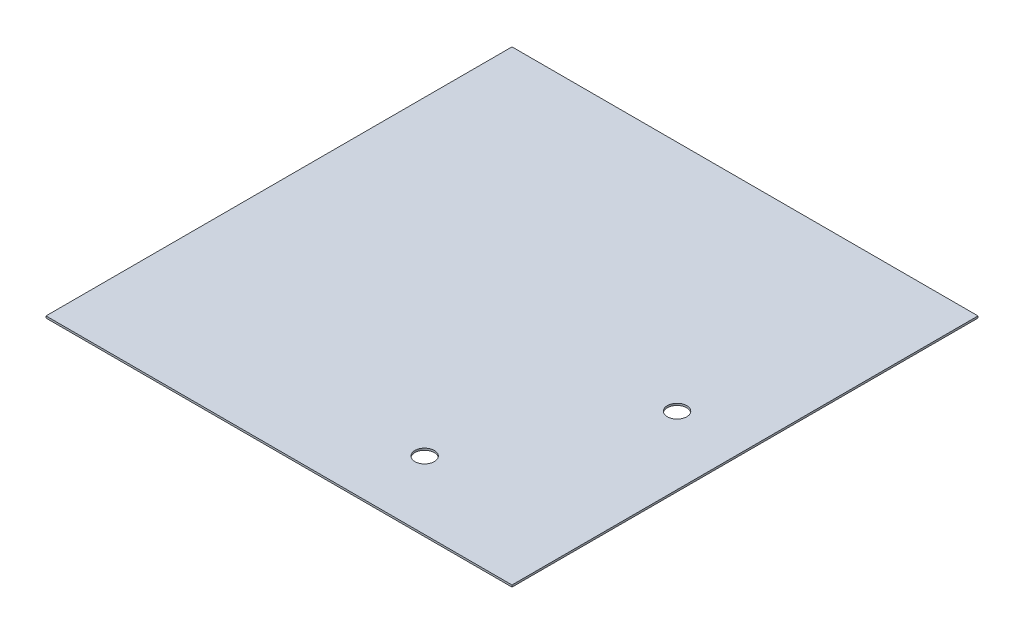
ISO-10303-21;
HEADER;
FILE_DESCRIPTION(('STEP AP214'),'2;1');
FILE_NAME('part.step','',(''),(''),'','','');
FILE_SCHEMA(('AUTOMOTIVE_DESIGN { 1 0 10303 214 1 1 1 1 }'));
ENDSEC;
DATA;
#1=APPLICATION_CONTEXT('core data for automotive mechanical design processes');
#2=APPLICATION_PROTOCOL_DEFINITION('international standard','automotive_design',2000,#1);
#3=PRODUCT_CONTEXT('',#1,'mechanical');
#4=PRODUCT('Part','Part','',(#3));
#5=PRODUCT_RELATED_PRODUCT_CATEGORY('part','',(#4));
#6=PRODUCT_DEFINITION_FORMATION('','',#4);
#7=PRODUCT_DEFINITION_CONTEXT('part definition',#1,'design');
#8=PRODUCT_DEFINITION('design','',#6,#7);
#9=PRODUCT_DEFINITION_SHAPE('','',#8);
#10=(LENGTH_UNIT() NAMED_UNIT(*) SI_UNIT(.MILLI.,.METRE.));
#11=(NAMED_UNIT(*) PLANE_ANGLE_UNIT() SI_UNIT($,.RADIAN.));
#12=(NAMED_UNIT(*) SI_UNIT($,.STERADIAN.) SOLID_ANGLE_UNIT());
#13=UNCERTAINTY_MEASURE_WITH_UNIT(LENGTH_MEASURE(1.E-05),#10,'distance_accuracy_value','');
#14=(GEOMETRIC_REPRESENTATION_CONTEXT(3) GLOBAL_UNCERTAINTY_ASSIGNED_CONTEXT((#13)) GLOBAL_UNIT_ASSIGNED_CONTEXT((#10,
#11,#12)) REPRESENTATION_CONTEXT('',''));
#15=CARTESIAN_POINT('',(0.,0.,0.));
#16=DIRECTION('',(0.,0.,1.));
#17=DIRECTION('',(1.,0.,0.));
#18=AXIS2_PLACEMENT_3D('',#15,#16,#17);
#19=CARTESIAN_POINT('',(304.8,2.5,304.8));
#20=DIRECTION('',(-1.,0.,0.));
#21=DIRECTION('',(0.,0.,1.));
#22=AXIS2_PLACEMENT_3D('',#19,#20,#21);
#23=PLANE('',#22);
#24=DIRECTION('',(0.,0.,-1.));
#25=VECTOR('',#24,1.);
#26=CARTESIAN_POINT('',(304.8,0.,304.8));
#27=LINE('',#26,#25);
#28=CARTESIAN_POINT('',(304.8,0.,304.8));
#29=VERTEX_POINT('',#28);
#30=CARTESIAN_POINT('',(304.8,0.,-304.8));
#31=VERTEX_POINT('',#30);
#32=EDGE_CURVE('E106',#29,#31,#27,.T.);
#33=ORIENTED_EDGE('',*,*,#32,.T.);
#34=DIRECTION('',(0.,-1.,0.));
#35=VECTOR('',#34,1.);
#36=CARTESIAN_POINT('',(304.8,2.5,-304.8));
#37=LINE('',#36,#35);
#38=CARTESIAN_POINT('',(304.8,2.5,-304.8));
#39=VERTEX_POINT('',#38);
#40=EDGE_CURVE('E11',#39,#31,#37,.T.);
#41=ORIENTED_EDGE('',*,*,#40,.F.);
#42=DIRECTION('',(0.,0.,-1.));
#43=VECTOR('',#42,1.);
#44=CARTESIAN_POINT('',(304.8,2.5,304.8));
#45=LINE('',#44,#43);
#46=CARTESIAN_POINT('',(304.8,2.5,304.8));
#47=VERTEX_POINT('',#46);
#48=EDGE_CURVE('E90',#47,#39,#45,.T.);
#49=ORIENTED_EDGE('',*,*,#48,.F.);
#50=DIRECTION('',(0.,-1.,0.));
#51=VECTOR('',#50,1.);
#52=CARTESIAN_POINT('',(304.8,2.5,304.8));
#53=LINE('',#52,#51);
#54=EDGE_CURVE('E102',#47,#29,#53,.T.);
#55=ORIENTED_EDGE('',*,*,#54,.T.);
#56=EDGE_LOOP('',(#33,#41,#49,#55));
#57=FACE_BOUND('',#56,.T.);
#58=ADVANCED_FACE('F38',(#57),#23,.F.);
#59=CARTESIAN_POINT('',(-304.8,2.5,-304.8));
#60=DIRECTION('',(0.,0.,1.));
#61=DIRECTION('',(1.,0.,0.));
#62=AXIS2_PLACEMENT_3D('',#59,#60,#61);
#63=PLANE('',#62);
#64=DIRECTION('',(-1.,0.,0.));
#65=VECTOR('',#64,1.);
#66=CARTESIAN_POINT('',(-304.8,0.,-304.8));
#67=LINE('',#66,#65);
#68=CARTESIAN_POINT('',(-304.8,0.,-304.8));
#69=VERTEX_POINT('',#68);
#70=EDGE_CURVE('E95',#31,#69,#67,.T.);
#71=ORIENTED_EDGE('',*,*,#70,.T.);
#72=DIRECTION('',(0.,-1.,0.));
#73=VECTOR('',#72,1.);
#74=CARTESIAN_POINT('',(-304.8,2.5,-304.8));
#75=LINE('',#74,#73);
#76=CARTESIAN_POINT('',(-304.8,2.5,-304.8));
#77=VERTEX_POINT('',#76);
#78=EDGE_CURVE('E47',#77,#69,#75,.T.);
#79=ORIENTED_EDGE('',*,*,#78,.F.);
#80=DIRECTION('',(-1.,0.,0.));
#81=VECTOR('',#80,1.);
#82=CARTESIAN_POINT('',(-304.8,2.5,-304.8));
#83=LINE('',#82,#81);
#84=EDGE_CURVE('E85',#39,#77,#83,.T.);
#85=ORIENTED_EDGE('',*,*,#84,.F.);
#86=ORIENTED_EDGE('',*,*,#40,.T.);
#87=EDGE_LOOP('',(#71,#79,#85,#86));
#88=FACE_BOUND('',#87,.T.);
#89=ADVANCED_FACE('F94',(#88),#63,.F.);
#90=CARTESIAN_POINT('',(-304.8,2.5,304.8));
#91=DIRECTION('',(1.,0.,0.));
#92=DIRECTION('',(0.,0.,-1.));
#93=AXIS2_PLACEMENT_3D('',#90,#91,#92);
#94=PLANE('',#93);
#95=DIRECTION('',(0.,0.,1.));
#96=VECTOR('',#95,1.);
#97=CARTESIAN_POINT('',(-304.8,0.,304.8));
#98=LINE('',#97,#96);
#99=CARTESIAN_POINT('',(-304.8,0.,304.8));
#100=VERTEX_POINT('',#99);
#101=EDGE_CURVE('E72',#69,#100,#98,.T.);
#102=ORIENTED_EDGE('',*,*,#101,.T.);
#103=DIRECTION('',(0.,-1.,0.));
#104=VECTOR('',#103,1.);
#105=CARTESIAN_POINT('',(-304.8,2.5,304.8));
#106=LINE('',#105,#104);
#107=CARTESIAN_POINT('',(-304.8,2.5,304.8));
#108=VERTEX_POINT('',#107);
#109=EDGE_CURVE('E97',#108,#100,#106,.T.);
#110=ORIENTED_EDGE('',*,*,#109,.F.);
#111=DIRECTION('',(0.,0.,1.));
#112=VECTOR('',#111,1.);
#113=CARTESIAN_POINT('',(-304.8,2.5,304.8));
#114=LINE('',#113,#112);
#115=EDGE_CURVE('E88',#77,#108,#114,.T.);
#116=ORIENTED_EDGE('',*,*,#115,.F.);
#117=ORIENTED_EDGE('',*,*,#78,.T.);
#118=EDGE_LOOP('',(#102,#110,#116,#117));
#119=FACE_BOUND('',#118,.T.);
#120=ADVANCED_FACE('F98',(#119),#94,.F.);
#121=CARTESIAN_POINT('',(-304.8,2.5,304.8));
#122=DIRECTION('',(0.,0.,-1.));
#123=DIRECTION('',(-1.,0.,0.));
#124=AXIS2_PLACEMENT_3D('',#121,#122,#123);
#125=PLANE('',#124);
#126=DIRECTION('',(1.,0.,0.));
#127=VECTOR('',#126,1.);
#128=CARTESIAN_POINT('',(-304.8,0.,304.8));
#129=LINE('',#128,#127);
#130=EDGE_CURVE('E78',#100,#29,#129,.T.);
#131=ORIENTED_EDGE('',*,*,#130,.T.);
#132=ORIENTED_EDGE('',*,*,#54,.F.);
#133=DIRECTION('',(1.,0.,0.));
#134=VECTOR('',#133,1.);
#135=CARTESIAN_POINT('',(-304.8,2.5,304.8));
#136=LINE('',#135,#134);
#137=EDGE_CURVE('E55',#108,#47,#136,.T.);
#138=ORIENTED_EDGE('',*,*,#137,.F.);
#139=ORIENTED_EDGE('',*,*,#109,.T.);
#140=EDGE_LOOP('',(#131,#132,#138,#139));
#141=FACE_BOUND('',#140,.T.);
#142=ADVANCED_FACE('F120',(#141),#125,.F.);
#143=CARTESIAN_POINT('',(0.,2.5,0.));
#144=DIRECTION('',(0.,-1.,0.));
#145=DIRECTION('',(0.,0.,-1.));
#146=AXIS2_PLACEMENT_3D('',#143,#144,#145);
#147=PLANE('',#146);
#148=CARTESIAN_POINT('',(101.6,2.5,215.9));
#149=DIRECTION('',(0.,1.,0.));
#150=DIRECTION('',(0.,0.,1.));
#151=AXIS2_PLACEMENT_3D('',#148,#149,#150);
#152=CIRCLE('',#151,12.7);
#153=CARTESIAN_POINT('',(101.6,2.5,228.6));
#154=VERTEX_POINT('',#153);
#155=EDGE_CURVE('E135',#154,#154,#152,.T.);
#156=ORIENTED_EDGE('',*,*,#155,.F.);
#157=EDGE_LOOP('',(#156));
#158=FACE_BOUND('',#157,.T.);
#159=CARTESIAN_POINT('',(215.9,2.5,0.));
#160=DIRECTION('',(0.,1.,0.));
#161=DIRECTION('',(0.,0.,1.));
#162=AXIS2_PLACEMENT_3D('',#159,#160,#161);
#163=CIRCLE('',#162,12.7);
#164=CARTESIAN_POINT('',(215.9,2.5,12.7));
#165=VERTEX_POINT('',#164);
#166=EDGE_CURVE('E127',#165,#165,#163,.T.);
#167=ORIENTED_EDGE('',*,*,#166,.F.);
#168=EDGE_LOOP('',(#167));
#169=FACE_BOUND('',#168,.T.);
#170=ORIENTED_EDGE('',*,*,#48,.T.);
#171=ORIENTED_EDGE('',*,*,#84,.T.);
#172=ORIENTED_EDGE('',*,*,#115,.T.);
#173=ORIENTED_EDGE('',*,*,#137,.T.);
#174=EDGE_LOOP('',(#170,#171,#172,#173));
#175=FACE_BOUND('',#174,.T.);
#176=ADVANCED_FACE('F86',(#158,#169,#175),#147,.F.);
#177=CARTESIAN_POINT('',(0.,0.,0.));
#178=DIRECTION('',(0.,-1.,0.));
#179=DIRECTION('',(0.,0.,-1.));
#180=AXIS2_PLACEMENT_3D('',#177,#178,#179);
#181=PLANE('',#180);
#182=CARTESIAN_POINT('',(101.6,0.,215.9));
#183=DIRECTION('',(0.,1.,0.));
#184=DIRECTION('',(0.,0.,1.));
#185=AXIS2_PLACEMENT_3D('',#182,#183,#184);
#186=CIRCLE('',#185,12.7);
#187=CARTESIAN_POINT('',(101.6,0.,228.6));
#188=VERTEX_POINT('',#187);
#189=EDGE_CURVE('E110',#188,#188,#186,.T.);
#190=ORIENTED_EDGE('',*,*,#189,.T.);
#191=EDGE_LOOP('',(#190));
#192=FACE_BOUND('',#191,.T.);
#193=CARTESIAN_POINT('',(215.9,0.,0.));
#194=DIRECTION('',(0.,1.,0.));
#195=DIRECTION('',(0.,0.,1.));
#196=AXIS2_PLACEMENT_3D('',#193,#194,#195);
#197=CIRCLE('',#196,12.7);
#198=CARTESIAN_POINT('',(215.9,0.,12.7));
#199=VERTEX_POINT('',#198);
#200=EDGE_CURVE('E131',#199,#199,#197,.T.);
#201=ORIENTED_EDGE('',*,*,#200,.T.);
#202=EDGE_LOOP('',(#201));
#203=FACE_BOUND('',#202,.T.);
#204=ORIENTED_EDGE('',*,*,#32,.F.);
#205=ORIENTED_EDGE('',*,*,#130,.F.);
#206=ORIENTED_EDGE('',*,*,#101,.F.);
#207=ORIENTED_EDGE('',*,*,#70,.F.);
#208=EDGE_LOOP('',(#204,#205,#206,#207));
#209=FACE_BOUND('',#208,.T.);
#210=ADVANCED_FACE('F123',(#192,#203,#209),#181,.T.);
#211=CARTESIAN_POINT('',(215.9,0.,0.));
#212=DIRECTION('',(0.,1.,0.));
#213=DIRECTION('',(0.,0.,1.));
#214=AXIS2_PLACEMENT_3D('',#211,#212,#213);
#215=CYLINDRICAL_SURFACE('',#214,12.7);
#216=ORIENTED_EDGE('',*,*,#200,.F.);
#217=EDGE_LOOP('',(#216));
#218=FACE_BOUND('',#217,.T.);
#219=ORIENTED_EDGE('',*,*,#166,.T.);
#220=EDGE_LOOP('',(#219));
#221=FACE_BOUND('',#220,.T.);
#222=ADVANCED_FACE('F148',(#218,#221),#215,.F.);
#223=CARTESIAN_POINT('',(101.6,0.,215.9));
#224=DIRECTION('',(0.,1.,0.));
#225=DIRECTION('',(0.,0.,1.));
#226=AXIS2_PLACEMENT_3D('',#223,#224,#225);
#227=CYLINDRICAL_SURFACE('',#226,12.7);
#228=ORIENTED_EDGE('',*,*,#189,.F.);
#229=EDGE_LOOP('',(#228));
#230=FACE_BOUND('',#229,.T.);
#231=ORIENTED_EDGE('',*,*,#155,.T.);
#232=EDGE_LOOP('',(#231));
#233=FACE_BOUND('',#232,.T.);
#234=ADVANCED_FACE('F145',(#230,#233),#227,.F.);
#235=CLOSED_SHELL('',(#58,#89,#120,#142,#176,#210,#222,#234));
#236=MANIFOLD_SOLID_BREP('B2',#235);
#237=ADVANCED_BREP_SHAPE_REPRESENTATION('',(#18,#236),#14);
#238=SHAPE_DEFINITION_REPRESENTATION(#9,#237);
ENDSEC;
END-ISO-10303-21;
